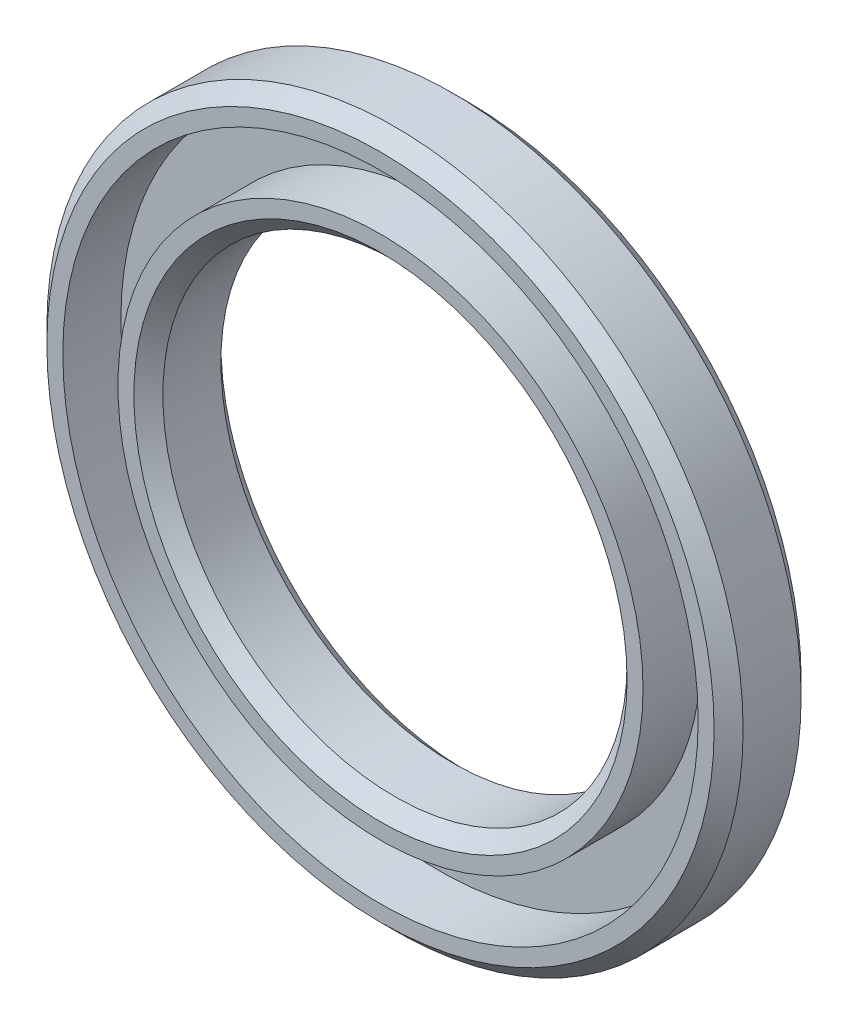
ISO-10303-21;
HEADER;
FILE_DESCRIPTION(('STEP AP214'),'2;1');
FILE_NAME('part.step','',(''),(''),'','','');
FILE_SCHEMA(('AUTOMOTIVE_DESIGN { 1 0 10303 214 1 1 1 1 }'));
ENDSEC;
DATA;
#1=APPLICATION_CONTEXT('core data for automotive mechanical design processes');
#2=APPLICATION_PROTOCOL_DEFINITION('international standard','automotive_design',2000,#1);
#3=PRODUCT_CONTEXT('',#1,'mechanical');
#4=PRODUCT('Part','Part','',(#3));
#5=PRODUCT_RELATED_PRODUCT_CATEGORY('part','',(#4));
#6=PRODUCT_DEFINITION_FORMATION('','',#4);
#7=PRODUCT_DEFINITION_CONTEXT('part definition',#1,'design');
#8=PRODUCT_DEFINITION('design','',#6,#7);
#9=PRODUCT_DEFINITION_SHAPE('','',#8);
#10=(LENGTH_UNIT() NAMED_UNIT(*) SI_UNIT(.MILLI.,.METRE.));
#11=(NAMED_UNIT(*) PLANE_ANGLE_UNIT() SI_UNIT($,.RADIAN.));
#12=(NAMED_UNIT(*) SI_UNIT($,.STERADIAN.) SOLID_ANGLE_UNIT());
#13=UNCERTAINTY_MEASURE_WITH_UNIT(LENGTH_MEASURE(1.E-05),#10,'distance_accuracy_value','');
#14=(GEOMETRIC_REPRESENTATION_CONTEXT(3) GLOBAL_UNCERTAINTY_ASSIGNED_CONTEXT((#13)) GLOBAL_UNIT_ASSIGNED_CONTEXT((#10,
#11,#12)) REPRESENTATION_CONTEXT('',''));
#15=CARTESIAN_POINT('',(0.,0.,0.));
#16=DIRECTION('',(0.,0.,1.));
#17=DIRECTION('',(1.,0.,0.));
#18=AXIS2_PLACEMENT_3D('',#15,#16,#17);
#19=CARTESIAN_POINT('',(0.,0.,3.));
#20=DIRECTION('',(0.,0.,1.));
#21=DIRECTION('',(1.,0.,0.));
#22=AXIS2_PLACEMENT_3D('',#19,#20,#21);
#23=PLANE('',#22);
#24=CARTESIAN_POINT('',(0.,0.,3.));
#25=DIRECTION('',(0.,0.,1.));
#26=DIRECTION('',(1.,0.,0.));
#27=AXIS2_PLACEMENT_3D('',#24,#25,#26);
#28=CIRCLE('',#27,8.5);
#29=CARTESIAN_POINT('',(8.5,0.,3.));
#30=VERTEX_POINT('',#29);
#31=EDGE_CURVE('E10',#30,#30,#28,.F.);
#32=ORIENTED_EDGE('',*,*,#31,.T.);
#33=EDGE_LOOP('',(#32));
#34=FACE_BOUND('',#33,.T.);
#35=CARTESIAN_POINT('',(0.,0.,3.));
#36=DIRECTION('',(0.,0.,1.));
#37=DIRECTION('',(1.,0.,0.));
#38=AXIS2_PLACEMENT_3D('',#35,#36,#37);
#39=CIRCLE('',#38,9.05);
#40=CARTESIAN_POINT('',(9.05,0.,3.));
#41=VERTEX_POINT('',#40);
#42=EDGE_CURVE('E69',#41,#41,#39,.T.);
#43=ORIENTED_EDGE('',*,*,#42,.T.);
#44=EDGE_LOOP('',(#43));
#45=FACE_BOUND('',#44,.T.);
#46=ADVANCED_FACE('F30',(#34,#45),#23,.T.);
#47=CARTESIAN_POINT('',(0.,0.,3.));
#48=DIRECTION('',(0.,0.,1.));
#49=DIRECTION('',(1.,0.,0.));
#50=AXIS2_PLACEMENT_3D('',#47,#48,#49);
#51=CIRCLE('',#50,10.95);
#52=CARTESIAN_POINT('',(10.95,0.,3.));
#53=VERTEX_POINT('',#52);
#54=EDGE_CURVE('E63',#53,#53,#51,.T.);
#55=ORIENTED_EDGE('',*,*,#54,.F.);
#56=EDGE_LOOP('',(#55));
#57=FACE_BOUND('',#56,.T.);
#58=CARTESIAN_POINT('',(0.,0.,3.));
#59=DIRECTION('',(0.,0.,1.));
#60=DIRECTION('',(1.,0.,0.));
#61=AXIS2_PLACEMENT_3D('',#58,#59,#60);
#62=CIRCLE('',#61,11.5);
#63=CARTESIAN_POINT('',(11.5,0.,3.));
#64=VERTEX_POINT('',#63);
#65=EDGE_CURVE('E37',#64,#64,#62,.T.);
#66=ORIENTED_EDGE('',*,*,#65,.T.);
#67=EDGE_LOOP('',(#66));
#68=FACE_BOUND('',#67,.T.);
#69=ADVANCED_FACE('F90',(#57,#68),#23,.T.);
#70=CARTESIAN_POINT('',(0.,0.,0.));
#71=DIRECTION('',(0.,0.,1.));
#72=DIRECTION('',(1.,0.,0.));
#73=AXIS2_PLACEMENT_3D('',#70,#71,#72);
#74=PLANE('',#73);
#75=CARTESIAN_POINT('',(0.,0.,0.));
#76=DIRECTION('',(0.,0.,1.));
#77=DIRECTION('',(1.,0.,0.));
#78=AXIS2_PLACEMENT_3D('',#75,#76,#77);
#79=CIRCLE('',#78,11.5);
#80=CARTESIAN_POINT('',(11.5,0.,0.));
#81=VERTEX_POINT('',#80);
#82=EDGE_CURVE('E50',#81,#81,#79,.F.);
#83=ORIENTED_EDGE('',*,*,#82,.T.);
#84=EDGE_LOOP('',(#83));
#85=FACE_BOUND('',#84,.T.);
#86=CARTESIAN_POINT('',(0.,0.,0.));
#87=DIRECTION('',(0.,0.,1.));
#88=DIRECTION('',(1.,0.,0.));
#89=AXIS2_PLACEMENT_3D('',#86,#87,#88);
#90=CIRCLE('',#89,8.5);
#91=CARTESIAN_POINT('',(8.5,0.,0.));
#92=VERTEX_POINT('',#91);
#93=EDGE_CURVE('E53',#92,#92,#90,.T.);
#94=ORIENTED_EDGE('',*,*,#93,.T.);
#95=EDGE_LOOP('',(#94));
#96=FACE_BOUND('',#95,.T.);
#97=ADVANCED_FACE('F92',(#85,#96),#74,.F.);
#98=CARTESIAN_POINT('',(0.,0.,3.));
#99=DIRECTION('',(0.,0.,-1.));
#100=DIRECTION('',(-1.,0.,0.));
#101=AXIS2_PLACEMENT_3D('',#98,#99,#100);
#102=CYLINDRICAL_SURFACE('',#101,12.);
#103=CARTESIAN_POINT('',(0.,0.,0.500000000000007));
#104=DIRECTION('',(0.,0.,1.));
#105=DIRECTION('',(1.,0.,0.));
#106=AXIS2_PLACEMENT_3D('',#103,#104,#105);
#107=CIRCLE('',#106,12.);
#108=CARTESIAN_POINT('',(12.,0.,0.500000000000007));
#109=VERTEX_POINT('',#108);
#110=EDGE_CURVE('E56',#109,#109,#107,.T.);
#111=ORIENTED_EDGE('',*,*,#110,.T.);
#112=EDGE_LOOP('',(#111));
#113=FACE_BOUND('',#112,.T.);
#114=CARTESIAN_POINT('',(0.,0.,2.5));
#115=DIRECTION('',(0.,0.,1.));
#116=DIRECTION('',(1.,0.,0.));
#117=AXIS2_PLACEMENT_3D('',#114,#115,#116);
#118=CIRCLE('',#117,12.);
#119=CARTESIAN_POINT('',(12.,0.,2.5));
#120=VERTEX_POINT('',#119);
#121=EDGE_CURVE('E59',#120,#120,#118,.F.);
#122=ORIENTED_EDGE('',*,*,#121,.T.);
#123=EDGE_LOOP('',(#122));
#124=FACE_BOUND('',#123,.T.);
#125=ADVANCED_FACE('F98',(#113,#124),#102,.T.);
#126=CARTESIAN_POINT('',(0.,0.,3.));
#127=DIRECTION('',(0.,0.,-1.));
#128=DIRECTION('',(-1.,0.,0.));
#129=AXIS2_PLACEMENT_3D('',#126,#127,#128);
#130=CYLINDRICAL_SURFACE('',#129,8.);
#131=CARTESIAN_POINT('',(0.,0.,0.500000000000002));
#132=DIRECTION('',(0.,0.,1.));
#133=DIRECTION('',(1.,0.,0.));
#134=AXIS2_PLACEMENT_3D('',#131,#132,#133);
#135=CIRCLE('',#134,8.);
#136=CARTESIAN_POINT('',(8.,0.,0.500000000000002));
#137=VERTEX_POINT('',#136);
#138=EDGE_CURVE('E41',#137,#137,#135,.F.);
#139=ORIENTED_EDGE('',*,*,#138,.T.);
#140=EDGE_LOOP('',(#139));
#141=FACE_BOUND('',#140,.T.);
#142=CARTESIAN_POINT('',(0.,0.,2.5));
#143=DIRECTION('',(0.,0.,1.));
#144=DIRECTION('',(1.,0.,0.));
#145=AXIS2_PLACEMENT_3D('',#142,#143,#144);
#146=CIRCLE('',#145,8.);
#147=CARTESIAN_POINT('',(8.,0.,2.5));
#148=VERTEX_POINT('',#147);
#149=EDGE_CURVE('E45',#148,#148,#146,.T.);
#150=ORIENTED_EDGE('',*,*,#149,.T.);
#151=EDGE_LOOP('',(#150));
#152=FACE_BOUND('',#151,.T.);
#153=ADVANCED_FACE('F102',(#141,#152),#130,.F.);
#154=CARTESIAN_POINT('',(0.,0.,0.500000000000007));
#155=DIRECTION('',(0.,0.,1.));
#156=DIRECTION('',(1.,0.,0.));
#157=AXIS2_PLACEMENT_3D('',#154,#155,#156);
#158=CONICAL_SURFACE('',#157,12.,0.785398163397448);
#159=ORIENTED_EDGE('',*,*,#82,.F.);
#160=EDGE_LOOP('',(#159));
#161=FACE_BOUND('',#160,.T.);
#162=ORIENTED_EDGE('',*,*,#110,.F.);
#163=EDGE_LOOP('',(#162));
#164=FACE_BOUND('',#163,.T.);
#165=ADVANCED_FACE('F107',(#161,#164),#158,.T.);
#166=CARTESIAN_POINT('',(0.,0.,0.));
#167=DIRECTION('',(0.,0.,-1.));
#168=DIRECTION('',(-1.,0.,0.));
#169=AXIS2_PLACEMENT_3D('',#166,#167,#168);
#170=CONICAL_SURFACE('',#169,8.5,0.785398163397447);
#171=ORIENTED_EDGE('',*,*,#138,.F.);
#172=EDGE_LOOP('',(#171));
#173=FACE_BOUND('',#172,.T.);
#174=ORIENTED_EDGE('',*,*,#93,.F.);
#175=EDGE_LOOP('',(#174));
#176=FACE_BOUND('',#175,.T.);
#177=ADVANCED_FACE('F110',(#173,#176),#170,.F.);
#178=CARTESIAN_POINT('',(0.,0.,2.5));
#179=DIRECTION('',(0.,0.,1.));
#180=DIRECTION('',(1.,0.,0.));
#181=AXIS2_PLACEMENT_3D('',#178,#179,#180);
#182=CONICAL_SURFACE('',#181,8.,0.785398163397453);
#183=ORIENTED_EDGE('',*,*,#31,.F.);
#184=EDGE_LOOP('',(#183));
#185=FACE_BOUND('',#184,.T.);
#186=ORIENTED_EDGE('',*,*,#149,.F.);
#187=EDGE_LOOP('',(#186));
#188=FACE_BOUND('',#187,.T.);
#189=ADVANCED_FACE('F113',(#185,#188),#182,.F.);
#190=CARTESIAN_POINT('',(0.,0.,3.));
#191=DIRECTION('',(0.,0.,-1.));
#192=DIRECTION('',(-1.,0.,0.));
#193=AXIS2_PLACEMENT_3D('',#190,#191,#192);
#194=CONICAL_SURFACE('',#193,11.5,0.785398163397448);
#195=ORIENTED_EDGE('',*,*,#121,.F.);
#196=EDGE_LOOP('',(#195));
#197=FACE_BOUND('',#196,.T.);
#198=ORIENTED_EDGE('',*,*,#65,.F.);
#199=EDGE_LOOP('',(#198));
#200=FACE_BOUND('',#199,.T.);
#201=ADVANCED_FACE('F32',(#197,#200),#194,.T.);
#202=CARTESIAN_POINT('',(0.,0.,1.));
#203=DIRECTION('',(0.,0.,1.));
#204=DIRECTION('',(1.,0.,0.));
#205=AXIS2_PLACEMENT_3D('',#202,#203,#204);
#206=CYLINDRICAL_SURFACE('',#205,10.95);
#207=CARTESIAN_POINT('',(0.,0.,1.));
#208=DIRECTION('',(0.,0.,1.));
#209=DIRECTION('',(1.,0.,0.));
#210=AXIS2_PLACEMENT_3D('',#207,#208,#209);
#211=CIRCLE('',#210,10.95);
#212=CARTESIAN_POINT('',(10.95,0.,1.));
#213=VERTEX_POINT('',#212);
#214=EDGE_CURVE('E62',#213,#213,#211,.T.);
#215=ORIENTED_EDGE('',*,*,#214,.F.);
#216=EDGE_LOOP('',(#215));
#217=FACE_BOUND('',#216,.T.);
#218=ORIENTED_EDGE('',*,*,#54,.T.);
#219=EDGE_LOOP('',(#218));
#220=FACE_BOUND('',#219,.T.);
#221=ADVANCED_FACE('F81',(#217,#220),#206,.F.);
#222=CARTESIAN_POINT('',(0.,0.,1.));
#223=DIRECTION('',(0.,0.,1.));
#224=DIRECTION('',(1.,0.,0.));
#225=AXIS2_PLACEMENT_3D('',#222,#223,#224);
#226=PLANE('',#225);
#227=CARTESIAN_POINT('',(0.,0.,1.));
#228=DIRECTION('',(0.,0.,1.));
#229=DIRECTION('',(1.,0.,0.));
#230=AXIS2_PLACEMENT_3D('',#227,#228,#229);
#231=CIRCLE('',#230,9.05);
#232=CARTESIAN_POINT('',(9.05,0.,1.));
#233=VERTEX_POINT('',#232);
#234=EDGE_CURVE('E66',#233,#233,#231,.T.);
#235=ORIENTED_EDGE('',*,*,#234,.F.);
#236=EDGE_LOOP('',(#235));
#237=FACE_BOUND('',#236,.T.);
#238=ORIENTED_EDGE('',*,*,#214,.T.);
#239=EDGE_LOOP('',(#238));
#240=FACE_BOUND('',#239,.T.);
#241=ADVANCED_FACE('F78',(#237,#240),#226,.T.);
#242=CARTESIAN_POINT('',(0.,0.,1.));
#243=DIRECTION('',(0.,0.,1.));
#244=DIRECTION('',(1.,0.,0.));
#245=AXIS2_PLACEMENT_3D('',#242,#243,#244);
#246=CYLINDRICAL_SURFACE('',#245,9.05);
#247=ORIENTED_EDGE('',*,*,#234,.T.);
#248=EDGE_LOOP('',(#247));
#249=FACE_BOUND('',#248,.T.);
#250=ORIENTED_EDGE('',*,*,#42,.F.);
#251=EDGE_LOOP('',(#250));
#252=FACE_BOUND('',#251,.T.);
#253=ADVANCED_FACE('F75',(#249,#252),#246,.T.);
#254=CLOSED_SHELL('',(#46,#69,#97,#125,#153,#165,#177,#189,#201,#221,#241,#253));
#255=MANIFOLD_SOLID_BREP('B2',#254);
#256=ADVANCED_BREP_SHAPE_REPRESENTATION('',(#18,#255),#14);
#257=SHAPE_DEFINITION_REPRESENTATION(#9,#256);
ENDSEC;
END-ISO-10303-21;
